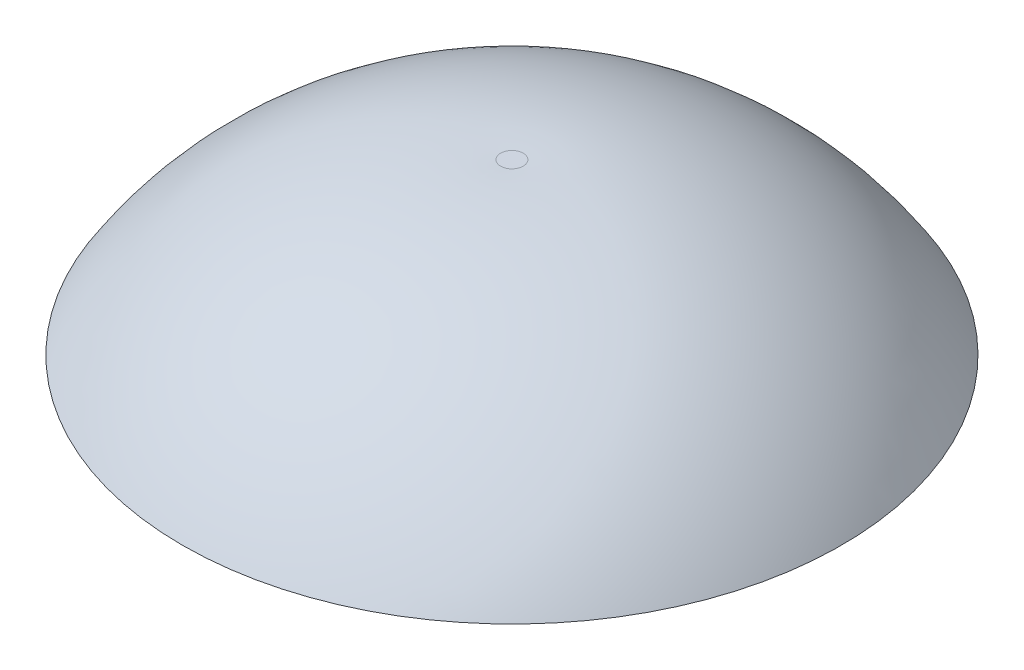
ISO-10303-21;
HEADER;
FILE_DESCRIPTION(('STEP AP214'),'2;1');
FILE_NAME('part.step','',(''),(''),'','','');
FILE_SCHEMA(('AUTOMOTIVE_DESIGN { 1 0 10303 214 1 1 1 1 }'));
ENDSEC;
DATA;
#1=APPLICATION_CONTEXT('core data for automotive mechanical design processes');
#2=APPLICATION_PROTOCOL_DEFINITION('international standard','automotive_design',2000,#1);
#3=PRODUCT_CONTEXT('',#1,'mechanical');
#4=PRODUCT('Part','Part','',(#3));
#5=PRODUCT_RELATED_PRODUCT_CATEGORY('part','',(#4));
#6=PRODUCT_DEFINITION_FORMATION('','',#4);
#7=PRODUCT_DEFINITION_CONTEXT('part definition',#1,'design');
#8=PRODUCT_DEFINITION('design','',#6,#7);
#9=PRODUCT_DEFINITION_SHAPE('','',#8);
#10=(LENGTH_UNIT() NAMED_UNIT(*) SI_UNIT(.MILLI.,.METRE.));
#11=(NAMED_UNIT(*) PLANE_ANGLE_UNIT() SI_UNIT($,.RADIAN.));
#12=(NAMED_UNIT(*) SI_UNIT($,.STERADIAN.) SOLID_ANGLE_UNIT());
#13=UNCERTAINTY_MEASURE_WITH_UNIT(LENGTH_MEASURE(1.E-05),#10,'distance_accuracy_value','');
#14=(GEOMETRIC_REPRESENTATION_CONTEXT(3) GLOBAL_UNCERTAINTY_ASSIGNED_CONTEXT((#13)) GLOBAL_UNIT_ASSIGNED_CONTEXT((#10,
#11,#12)) REPRESENTATION_CONTEXT('',''));
#15=CARTESIAN_POINT('',(0.,0.,0.));
#16=DIRECTION('',(0.,0.,1.));
#17=DIRECTION('',(1.,0.,0.));
#18=AXIS2_PLACEMENT_3D('',#15,#16,#17);
#19=CARTESIAN_POINT('',(0.,101.6,0.));
#20=DIRECTION('',(0.,1.,0.));
#21=DIRECTION('',(0.,0.,1.));
#22=AXIS2_PLACEMENT_3D('',#19,#20,#21);
#23=PLANE('',#22);
#24=DIRECTION('',(-0.707106781186546,0.,-0.707106781186549));
#25=VECTOR('',#24,1.);
#26=CARTESIAN_POINT('',(0.,101.6,0.));
#27=LINE('',#26,#25);
#28=CARTESIAN_POINT('',(-4.49012806053457,101.6,-4.49012806053458));
#29=VERTEX_POINT('',#28);
#30=CARTESIAN_POINT('',(-6.73519209080185,101.6,-6.73519209080188));
#31=VERTEX_POINT('',#30);
#32=EDGE_CURVE('E166',#29,#31,#27,.T.);
#33=ORIENTED_EDGE('',*,*,#32,.T.);
#34=CARTESIAN_POINT('',(0.,101.6,0.));
#35=DIRECTION('',(0.,1.,0.));
#36=DIRECTION('',(0.,0.,1.));
#37=AXIS2_PLACEMENT_3D('',#34,#35,#36);
#38=CIRCLE('',#37,9.525);
#39=CARTESIAN_POINT('',(6.73519209080185,101.6,-6.73519209080188));
#40=VERTEX_POINT('',#39);
#41=EDGE_CURVE('E228',#40,#31,#38,.T.);
#42=ORIENTED_EDGE('',*,*,#41,.F.);
#43=DIRECTION('',(0.707106781186546,0.,-0.707106781186549));
#44=VECTOR('',#43,1.);
#45=CARTESIAN_POINT('',(0.,101.6,0.));
#46=LINE('',#45,#44);
#47=CARTESIAN_POINT('',(4.49012806053457,101.6,-4.49012806053458));
#48=VERTEX_POINT('',#47);
#49=EDGE_CURVE('E193',#48,#40,#46,.T.);
#50=ORIENTED_EDGE('',*,*,#49,.F.);
#51=CARTESIAN_POINT('',(0.,101.6,0.));
#52=DIRECTION('',(0.,1.,0.));
#53=DIRECTION('',(0.,0.,1.));
#54=AXIS2_PLACEMENT_3D('',#51,#52,#53);
#55=CIRCLE('',#54,6.35);
#56=CARTESIAN_POINT('',(4.49012806053457,101.6,4.49012806053458));
#57=VERTEX_POINT('',#56);
#58=EDGE_CURVE('E60',#57,#48,#55,.T.);
#59=ORIENTED_EDGE('',*,*,#58,.F.);
#60=DIRECTION('',(0.707106781186546,0.,0.707106781186549));
#61=VECTOR('',#60,1.);
#62=CARTESIAN_POINT('',(0.,101.6,0.));
#63=LINE('',#62,#61);
#64=CARTESIAN_POINT('',(6.73519209080185,101.6,6.73519209080188));
#65=VERTEX_POINT('',#64);
#66=EDGE_CURVE('E211',#57,#65,#63,.T.);
#67=ORIENTED_EDGE('',*,*,#66,.T.);
#68=CARTESIAN_POINT('',(-6.73519209080185,101.6,6.73519209080188));
#69=VERTEX_POINT('',#68);
#70=EDGE_CURVE('E227',#69,#65,#38,.T.);
#71=ORIENTED_EDGE('',*,*,#70,.F.);
#72=DIRECTION('',(-0.707106781186546,0.,0.707106781186549));
#73=VECTOR('',#72,1.);
#74=CARTESIAN_POINT('',(0.,101.6,0.));
#75=LINE('',#74,#73);
#76=CARTESIAN_POINT('',(-4.49012806053457,101.6,4.49012806053458));
#77=VERTEX_POINT('',#76);
#78=EDGE_CURVE('E154',#77,#69,#75,.T.);
#79=ORIENTED_EDGE('',*,*,#78,.F.);
#80=CARTESIAN_POINT('',(0.,101.6,0.));
#81=DIRECTION('',(0.,1.,0.));
#82=DIRECTION('',(0.,0.,1.));
#83=AXIS2_PLACEMENT_3D('',#80,#81,#82);
#84=CIRCLE('',#83,6.35);
#85=EDGE_CURVE('E179',#29,#77,#84,.T.);
#86=ORIENTED_EDGE('',*,*,#85,.F.);
#87=EDGE_LOOP('',(#33,#42,#50,#59,#67,#71,#79,#86));
#88=FACE_BOUND('',#87,.T.);
#89=ADVANCED_FACE('F38',(#88),#23,.F.);
#90=CARTESIAN_POINT('',(0.,133.35,0.));
#91=DIRECTION('',(0.,1.,0.));
#92=DIRECTION('',(0.,0.,1.));
#93=AXIS2_PLACEMENT_3D('',#90,#91,#92);
#94=CYLINDRICAL_SURFACE('',#93,9.525);
#95=ORIENTED_EDGE('',*,*,#41,.T.);
#96=DIRECTION('',(0.,-1.,0.));
#97=VECTOR('',#96,1.);
#98=CARTESIAN_POINT('',(-6.73519209080185,0.,-6.73519209080188));
#99=LINE('',#98,#97);
#100=CARTESIAN_POINT('',(-6.73519209080185,95.25,-6.73519209080188));
#101=VERTEX_POINT('',#100);
#102=EDGE_CURVE('E169',#31,#101,#99,.T.);
#103=ORIENTED_EDGE('',*,*,#102,.T.);
#104=CARTESIAN_POINT('',(0.,95.25,0.));
#105=DIRECTION('',(0.,1.,0.));
#106=DIRECTION('',(0.,0.,1.));
#107=AXIS2_PLACEMENT_3D('',#104,#105,#106);
#108=CIRCLE('',#107,9.525);
#109=CARTESIAN_POINT('',(-6.73519209080185,95.25,6.73519209080188));
#110=VERTEX_POINT('',#109);
#111=EDGE_CURVE('E177',#101,#110,#108,.T.);
#112=ORIENTED_EDGE('',*,*,#111,.T.);
#113=DIRECTION('',(0.,-1.,0.));
#114=VECTOR('',#113,1.);
#115=CARTESIAN_POINT('',(-6.73519209080185,0.,6.73519209080188));
#116=LINE('',#115,#114);
#117=EDGE_CURVE('E52',#69,#110,#116,.T.);
#118=ORIENTED_EDGE('',*,*,#117,.F.);
#119=ORIENTED_EDGE('',*,*,#70,.T.);
#120=DIRECTION('',(0.,-1.,0.));
#121=VECTOR('',#120,1.);
#122=CARTESIAN_POINT('',(6.73519209080185,0.,6.73519209080188));
#123=LINE('',#122,#121);
#124=CARTESIAN_POINT('',(6.73519209080185,95.25,6.73519209080188));
#125=VERTEX_POINT('',#124);
#126=EDGE_CURVE('E208',#65,#125,#123,.T.);
#127=ORIENTED_EDGE('',*,*,#126,.T.);
#128=CARTESIAN_POINT('',(0.,95.25,0.));
#129=DIRECTION('',(0.,1.,0.));
#130=DIRECTION('',(0.,0.,1.));
#131=AXIS2_PLACEMENT_3D('',#128,#129,#130);
#132=CIRCLE('',#131,9.525);
#133=CARTESIAN_POINT('',(6.73519209080185,95.25,-6.73519209080188));
#134=VERTEX_POINT('',#133);
#135=EDGE_CURVE('E219',#125,#134,#132,.T.);
#136=ORIENTED_EDGE('',*,*,#135,.T.);
#137=DIRECTION('',(0.,-1.,0.));
#138=VECTOR('',#137,1.);
#139=CARTESIAN_POINT('',(6.73519209080185,0.,-6.73519209080188));
#140=LINE('',#139,#138);
#141=EDGE_CURVE('E190',#40,#134,#140,.T.);
#142=ORIENTED_EDGE('',*,*,#141,.F.);
#143=EDGE_LOOP('',(#95,#103,#112,#118,#119,#127,#136,#142));
#144=FACE_BOUND('',#143,.T.);
#145=CARTESIAN_POINT('',(0.,104.902,0.));
#146=DIRECTION('',(0.,1.,0.));
#147=DIRECTION('',(0.,0.,1.));
#148=AXIS2_PLACEMENT_3D('',#145,#146,#147);
#149=CIRCLE('',#148,9.525);
#150=CARTESIAN_POINT('',(0.,104.902,9.525));
#151=VERTEX_POINT('',#150);
#152=EDGE_CURVE('E225',#151,#151,#149,.T.);
#153=ORIENTED_EDGE('',*,*,#152,.F.);
#154=EDGE_LOOP('',(#153));
#155=FACE_BOUND('',#154,.T.);
#156=ADVANCED_FACE('F233',(#144,#155),#94,.T.);
#157=CARTESIAN_POINT('',(0.,104.902,0.));
#158=DIRECTION('',(0.,1.,0.));
#159=DIRECTION('',(0.,0.,1.));
#160=AXIS2_PLACEMENT_3D('',#157,#158,#159);
#161=PLANE('',#160);
#162=CARTESIAN_POINT('',(0.,104.902,0.));
#163=DIRECTION('',(0.,1.,0.));
#164=DIRECTION('',(0.,0.,1.));
#165=AXIS2_PLACEMENT_3D('',#162,#163,#164);
#166=CIRCLE('',#165,2.54);
#167=CARTESIAN_POINT('',(0.,104.902,2.54));
#168=VERTEX_POINT('',#167);
#169=EDGE_CURVE('E45',#168,#168,#166,.T.);
#170=ORIENTED_EDGE('',*,*,#169,.F.);
#171=EDGE_LOOP('',(#170));
#172=FACE_BOUND('',#171,.T.);
#173=ORIENTED_EDGE('',*,*,#152,.T.);
#174=EDGE_LOOP('',(#173));
#175=FACE_BOUND('',#174,.T.);
#176=ADVANCED_FACE('F258',(#172,#175),#161,.T.);
#177=CARTESIAN_POINT('',(0.,97.79,0.));
#178=DIRECTION('',(0.,1.,0.));
#179=DIRECTION('',(0.,0.,1.));
#180=AXIS2_PLACEMENT_3D('',#177,#178,#179);
#181=PLANE('',#180);
#182=CARTESIAN_POINT('',(0.,97.79,0.));
#183=DIRECTION('',(0.,1.,0.));
#184=DIRECTION('',(0.,0.,1.));
#185=AXIS2_PLACEMENT_3D('',#182,#183,#184);
#186=CIRCLE('',#185,3.93700000000001);
#187=CARTESIAN_POINT('',(2.78387939753144,97.79,2.78387939753145));
#188=VERTEX_POINT('',#187);
#189=CARTESIAN_POINT('',(2.78387939753144,97.79,-2.78387939753145));
#190=VERTEX_POINT('',#189);
#191=EDGE_CURVE('E223',#188,#190,#186,.T.);
#192=ORIENTED_EDGE('',*,*,#191,.F.);
#193=DIRECTION('',(0.707106781186546,0.,0.707106781186549));
#194=VECTOR('',#193,1.);
#195=CARTESIAN_POINT('',(0.,97.79,0.));
#196=LINE('',#195,#194);
#197=CARTESIAN_POINT('',(4.49012806053457,97.79,4.49012806053458));
#198=VERTEX_POINT('',#197);
#199=EDGE_CURVE('E199',#188,#198,#196,.T.);
#200=ORIENTED_EDGE('',*,*,#199,.T.);
#201=CARTESIAN_POINT('',(0.,97.79,0.));
#202=DIRECTION('',(0.,1.,0.));
#203=DIRECTION('',(0.,0.,1.));
#204=AXIS2_PLACEMENT_3D('',#201,#202,#203);
#205=CIRCLE('',#204,6.35);
#206=CARTESIAN_POINT('',(4.49012806053457,97.79,-4.49012806053458));
#207=VERTEX_POINT('',#206);
#208=EDGE_CURVE('E216',#198,#207,#205,.T.);
#209=ORIENTED_EDGE('',*,*,#208,.T.);
#210=DIRECTION('',(0.707106781186546,0.,-0.707106781186549));
#211=VECTOR('',#210,1.);
#212=CARTESIAN_POINT('',(0.,97.79,0.));
#213=LINE('',#212,#211);
#214=EDGE_CURVE('E138',#190,#207,#213,.T.);
#215=ORIENTED_EDGE('',*,*,#214,.F.);
#216=EDGE_LOOP('',(#192,#200,#209,#215));
#217=FACE_BOUND('',#216,.T.);
#218=ADVANCED_FACE('F256',(#217),#181,.T.);
#219=CARTESIAN_POINT('',(0.,133.35,0.));
#220=DIRECTION('',(0.,1.,0.));
#221=DIRECTION('',(0.,0.,1.));
#222=AXIS2_PLACEMENT_3D('',#219,#220,#221);
#223=CYLINDRICAL_SURFACE('',#222,3.93700000000001);
#224=CARTESIAN_POINT('',(0.,95.25,0.));
#225=DIRECTION('',(0.,1.,0.));
#226=DIRECTION('',(0.,0.,1.));
#227=AXIS2_PLACEMENT_3D('',#224,#225,#226);
#228=CIRCLE('',#227,3.93700000000001);
#229=CARTESIAN_POINT('',(2.78387939753144,95.25,2.78387939753145));
#230=VERTEX_POINT('',#229);
#231=CARTESIAN_POINT('',(2.78387939753144,95.25,-2.78387939753145));
#232=VERTEX_POINT('',#231);
#233=EDGE_CURVE('E221',#230,#232,#228,.T.);
#234=ORIENTED_EDGE('',*,*,#233,.F.);
#235=DIRECTION('',(0.,-1.,0.));
#236=VECTOR('',#235,1.);
#237=CARTESIAN_POINT('',(2.78387939753144,0.,2.78387939753145));
#238=LINE('',#237,#236);
#239=EDGE_CURVE('E202',#188,#230,#238,.T.);
#240=ORIENTED_EDGE('',*,*,#239,.F.);
#241=ORIENTED_EDGE('',*,*,#191,.T.);
#242=DIRECTION('',(0.,-1.,0.));
#243=VECTOR('',#242,1.);
#244=CARTESIAN_POINT('',(2.78387939753144,0.,-2.78387939753145));
#245=LINE('',#244,#243);
#246=EDGE_CURVE('E184',#190,#232,#245,.T.);
#247=ORIENTED_EDGE('',*,*,#246,.T.);
#248=EDGE_LOOP('',(#234,#240,#241,#247));
#249=FACE_BOUND('',#248,.T.);
#250=ADVANCED_FACE('F253',(#249),#223,.F.);
#251=CARTESIAN_POINT('',(0.,95.25,0.));
#252=DIRECTION('',(0.,1.,0.));
#253=DIRECTION('',(0.,0.,1.));
#254=AXIS2_PLACEMENT_3D('',#251,#252,#253);
#255=PLANE('',#254);
#256=ORIENTED_EDGE('',*,*,#135,.F.);
#257=DIRECTION('',(0.707106781186546,0.,0.707106781186549));
#258=VECTOR('',#257,1.);
#259=CARTESIAN_POINT('',(0.,95.25,0.));
#260=LINE('',#259,#258);
#261=EDGE_CURVE('E205',#230,#125,#260,.T.);
#262=ORIENTED_EDGE('',*,*,#261,.F.);
#263=ORIENTED_EDGE('',*,*,#233,.T.);
#264=DIRECTION('',(0.707106781186546,0.,-0.707106781186549));
#265=VECTOR('',#264,1.);
#266=CARTESIAN_POINT('',(0.,95.25,0.));
#267=LINE('',#266,#265);
#268=EDGE_CURVE('E187',#232,#134,#267,.T.);
#269=ORIENTED_EDGE('',*,*,#268,.T.);
#270=EDGE_LOOP('',(#256,#262,#263,#269));
#271=FACE_BOUND('',#270,.T.);
#272=ADVANCED_FACE('F244',(#271),#255,.F.);
#273=CARTESIAN_POINT('',(0.,133.35,0.));
#274=DIRECTION('',(0.,1.,0.));
#275=DIRECTION('',(0.,0.,1.));
#276=AXIS2_PLACEMENT_3D('',#273,#274,#275);
#277=CYLINDRICAL_SURFACE('',#276,6.35);
#278=DIRECTION('',(0.,-1.,0.));
#279=VECTOR('',#278,1.);
#280=CARTESIAN_POINT('',(4.49012806053457,0.,4.49012806053458));
#281=LINE('',#280,#279);
#282=EDGE_CURVE('E213',#57,#198,#281,.T.);
#283=ORIENTED_EDGE('',*,*,#282,.F.);
#284=ORIENTED_EDGE('',*,*,#58,.T.);
#285=DIRECTION('',(0.,-1.,0.));
#286=VECTOR('',#285,1.);
#287=CARTESIAN_POINT('',(4.49012806053457,0.,-4.49012806053458));
#288=LINE('',#287,#286);
#289=EDGE_CURVE('E196',#48,#207,#288,.T.);
#290=ORIENTED_EDGE('',*,*,#289,.T.);
#291=ORIENTED_EDGE('',*,*,#208,.F.);
#292=EDGE_LOOP('',(#283,#284,#290,#291));
#293=FACE_BOUND('',#292,.T.);
#294=ADVANCED_FACE('F250',(#293),#277,.F.);
#295=CARTESIAN_POINT('',(0.,0.,0.));
#296=DIRECTION('',(-0.707106781186549,0.,0.707106781186546));
#297=DIRECTION('',(0.707106781186546,0.,0.707106781186549));
#298=AXIS2_PLACEMENT_3D('',#295,#296,#297);
#299=PLANE('',#298);
#300=ORIENTED_EDGE('',*,*,#199,.F.);
#301=ORIENTED_EDGE('',*,*,#239,.T.);
#302=ORIENTED_EDGE('',*,*,#261,.T.);
#303=ORIENTED_EDGE('',*,*,#126,.F.);
#304=ORIENTED_EDGE('',*,*,#66,.F.);
#305=ORIENTED_EDGE('',*,*,#282,.T.);
#306=EDGE_LOOP('',(#300,#301,#302,#303,#304,#305));
#307=FACE_BOUND('',#306,.T.);
#308=ADVANCED_FACE('F240',(#307),#299,.T.);
#309=CARTESIAN_POINT('',(0.,0.,0.));
#310=DIRECTION('',(0.707106781186549,0.,0.707106781186546));
#311=DIRECTION('',(0.707106781186546,0.,-0.707106781186549));
#312=AXIS2_PLACEMENT_3D('',#309,#310,#311);
#313=PLANE('',#312);
#314=ORIENTED_EDGE('',*,*,#214,.T.);
#315=ORIENTED_EDGE('',*,*,#289,.F.);
#316=ORIENTED_EDGE('',*,*,#49,.T.);
#317=ORIENTED_EDGE('',*,*,#141,.T.);
#318=ORIENTED_EDGE('',*,*,#268,.F.);
#319=ORIENTED_EDGE('',*,*,#246,.F.);
#320=EDGE_LOOP('',(#314,#315,#316,#317,#318,#319));
#321=FACE_BOUND('',#320,.T.);
#322=ADVANCED_FACE('F248',(#321),#313,.F.);
#323=CARTESIAN_POINT('',(0.,133.35,0.));
#324=DIRECTION('',(0.,1.,0.));
#325=DIRECTION('',(0.,0.,1.));
#326=AXIS2_PLACEMENT_3D('',#323,#324,#325);
#327=CYLINDRICAL_SURFACE('',#326,3.93700000000001);
#328=CARTESIAN_POINT('',(0.,97.79,0.));
#329=DIRECTION('',(0.,1.,0.));
#330=DIRECTION('',(0.,0.,1.));
#331=AXIS2_PLACEMENT_3D('',#328,#329,#330);
#332=CIRCLE('',#331,3.93700000000001);
#333=CARTESIAN_POINT('',(-2.78387939753144,97.79,-2.78387939753145));
#334=VERTEX_POINT('',#333);
#335=CARTESIAN_POINT('',(-2.78387939753144,97.79,2.78387939753145));
#336=VERTEX_POINT('',#335);
#337=EDGE_CURVE('E127',#334,#336,#332,.T.);
#338=ORIENTED_EDGE('',*,*,#337,.T.);
#339=DIRECTION('',(0.,-1.,0.));
#340=VECTOR('',#339,1.);
#341=CARTESIAN_POINT('',(-2.78387939753144,0.,2.78387939753145));
#342=LINE('',#341,#340);
#343=CARTESIAN_POINT('',(-2.78387939753144,95.25,2.78387939753145));
#344=VERTEX_POINT('',#343);
#345=EDGE_CURVE('E130',#336,#344,#342,.T.);
#346=ORIENTED_EDGE('',*,*,#345,.T.);
#347=CARTESIAN_POINT('',(0.,95.25,0.));
#348=DIRECTION('',(0.,1.,0.));
#349=DIRECTION('',(0.,0.,1.));
#350=AXIS2_PLACEMENT_3D('',#347,#348,#349);
#351=CIRCLE('',#350,3.93700000000001);
#352=CARTESIAN_POINT('',(-2.78387939753144,95.25,-2.78387939753145));
#353=VERTEX_POINT('',#352);
#354=EDGE_CURVE('E175',#353,#344,#351,.T.);
#355=ORIENTED_EDGE('',*,*,#354,.F.);
#356=DIRECTION('',(0.,-1.,0.));
#357=VECTOR('',#356,1.);
#358=CARTESIAN_POINT('',(-2.78387939753144,0.,-2.78387939753145));
#359=LINE('',#358,#357);
#360=EDGE_CURVE('E133',#334,#353,#359,.T.);
#361=ORIENTED_EDGE('',*,*,#360,.F.);
#362=EDGE_LOOP('',(#338,#346,#355,#361));
#363=FACE_BOUND('',#362,.T.);
#364=ADVANCED_FACE('F129',(#363),#327,.F.);
#365=CARTESIAN_POINT('',(0.,97.79,0.));
#366=DIRECTION('',(0.,1.,0.));
#367=DIRECTION('',(0.,0.,1.));
#368=AXIS2_PLACEMENT_3D('',#365,#366,#367);
#369=PLANE('',#368);
#370=CARTESIAN_POINT('',(0.,97.79,0.));
#371=DIRECTION('',(0.,1.,0.));
#372=DIRECTION('',(0.,0.,1.));
#373=AXIS2_PLACEMENT_3D('',#370,#371,#372);
#374=CIRCLE('',#373,6.35);
#375=CARTESIAN_POINT('',(-4.49012806053457,97.79,-4.49012806053458));
#376=VERTEX_POINT('',#375);
#377=CARTESIAN_POINT('',(-4.49012806053457,97.79,4.49012806053458));
#378=VERTEX_POINT('',#377);
#379=EDGE_CURVE('E139',#376,#378,#374,.T.);
#380=ORIENTED_EDGE('',*,*,#379,.T.);
#381=DIRECTION('',(-0.707106781186546,0.,0.707106781186549));
#382=VECTOR('',#381,1.);
#383=CARTESIAN_POINT('',(0.,97.79,0.));
#384=LINE('',#383,#382);
#385=EDGE_CURVE('E145',#336,#378,#384,.T.);
#386=ORIENTED_EDGE('',*,*,#385,.F.);
#387=ORIENTED_EDGE('',*,*,#337,.F.);
#388=DIRECTION('',(-0.707106781186546,0.,-0.707106781186549));
#389=VECTOR('',#388,1.);
#390=CARTESIAN_POINT('',(0.,97.79,0.));
#391=LINE('',#390,#389);
#392=EDGE_CURVE('E162',#334,#376,#391,.T.);
#393=ORIENTED_EDGE('',*,*,#392,.T.);
#394=EDGE_LOOP('',(#380,#386,#387,#393));
#395=FACE_BOUND('',#394,.T.);
#396=ADVANCED_FACE('F151',(#395),#369,.T.);
#397=CARTESIAN_POINT('',(0.,133.35,0.));
#398=DIRECTION('',(0.,1.,0.));
#399=DIRECTION('',(0.,0.,1.));
#400=AXIS2_PLACEMENT_3D('',#397,#398,#399);
#401=CYLINDRICAL_SURFACE('',#400,6.35);
#402=ORIENTED_EDGE('',*,*,#85,.T.);
#403=DIRECTION('',(0.,1.,0.));
#404=VECTOR('',#403,1.);
#405=CARTESIAN_POINT('',(-4.49012806053457,0.,4.49012806053458));
#406=LINE('',#405,#404);
#407=EDGE_CURVE('E152',#378,#77,#406,.T.);
#408=ORIENTED_EDGE('',*,*,#407,.F.);
#409=ORIENTED_EDGE('',*,*,#379,.F.);
#410=DIRECTION('',(0.,1.,0.));
#411=VECTOR('',#410,1.);
#412=CARTESIAN_POINT('',(-4.49012806053457,0.,-4.49012806053458));
#413=LINE('',#412,#411);
#414=EDGE_CURVE('E164',#376,#29,#413,.T.);
#415=ORIENTED_EDGE('',*,*,#414,.T.);
#416=EDGE_LOOP('',(#402,#408,#409,#415));
#417=FACE_BOUND('',#416,.T.);
#418=ADVANCED_FACE('F288',(#417),#401,.F.);
#419=CARTESIAN_POINT('',(0.,95.25,0.));
#420=DIRECTION('',(0.,1.,0.));
#421=DIRECTION('',(0.,0.,1.));
#422=AXIS2_PLACEMENT_3D('',#419,#420,#421);
#423=PLANE('',#422);
#424=DIRECTION('',(-0.707106781186546,0.,-0.707106781186549));
#425=VECTOR('',#424,1.);
#426=CARTESIAN_POINT('',(0.,95.25,0.));
#427=LINE('',#426,#425);
#428=EDGE_CURVE('E172',#353,#101,#427,.T.);
#429=ORIENTED_EDGE('',*,*,#428,.F.);
#430=ORIENTED_EDGE('',*,*,#354,.T.);
#431=DIRECTION('',(-0.707106781186546,0.,0.707106781186549));
#432=VECTOR('',#431,1.);
#433=CARTESIAN_POINT('',(0.,95.25,0.));
#434=LINE('',#433,#432);
#435=EDGE_CURVE('E148',#344,#110,#434,.T.);
#436=ORIENTED_EDGE('',*,*,#435,.T.);
#437=ORIENTED_EDGE('',*,*,#111,.F.);
#438=EDGE_LOOP('',(#429,#430,#436,#437));
#439=FACE_BOUND('',#438,.T.);
#440=ADVANCED_FACE('F291',(#439),#423,.F.);
#441=CARTESIAN_POINT('',(0.,0.,0.));
#442=DIRECTION('',(-0.707106781186549,0.,0.707106781186546));
#443=DIRECTION('',(0.707106781186546,0.,0.707106781186549));
#444=AXIS2_PLACEMENT_3D('',#441,#442,#443);
#445=PLANE('',#444);
#446=ORIENTED_EDGE('',*,*,#360,.T.);
#447=ORIENTED_EDGE('',*,*,#428,.T.);
#448=ORIENTED_EDGE('',*,*,#102,.F.);
#449=ORIENTED_EDGE('',*,*,#32,.F.);
#450=ORIENTED_EDGE('',*,*,#414,.F.);
#451=ORIENTED_EDGE('',*,*,#392,.F.);
#452=EDGE_LOOP('',(#446,#447,#448,#449,#450,#451));
#453=FACE_BOUND('',#452,.T.);
#454=ADVANCED_FACE('F295',(#453),#445,.F.);
#455=CARTESIAN_POINT('',(0.,0.,0.));
#456=DIRECTION('',(0.707106781186549,0.,0.707106781186546));
#457=DIRECTION('',(0.707106781186546,0.,-0.707106781186549));
#458=AXIS2_PLACEMENT_3D('',#455,#456,#457);
#459=PLANE('',#458);
#460=ORIENTED_EDGE('',*,*,#345,.F.);
#461=ORIENTED_EDGE('',*,*,#385,.T.);
#462=ORIENTED_EDGE('',*,*,#407,.T.);
#463=ORIENTED_EDGE('',*,*,#78,.T.);
#464=ORIENTED_EDGE('',*,*,#117,.T.);
#465=ORIENTED_EDGE('',*,*,#435,.F.);
#466=EDGE_LOOP('',(#460,#461,#462,#463,#464,#465));
#467=FACE_BOUND('',#466,.T.);
#468=ADVANCED_FACE('F143',(#467),#459,.T.);
#469=CARTESIAN_POINT('',(0.,133.35,0.));
#470=DIRECTION('',(0.,1.,0.));
#471=DIRECTION('',(0.,0.,1.));
#472=AXIS2_PLACEMENT_3D('',#469,#470,#471);
#473=CYLINDRICAL_SURFACE('',#472,2.54);
#474=CARTESIAN_POINT('',(0.,130.866278234987,0.));
#475=DIRECTION('',(0.,-1.,0.));
#476=DIRECTION('',(0.,0.,-1.));
#477=AXIS2_PLACEMENT_3D('',#474,#475,#476);
#478=CIRCLE('',#477,2.54);
#479=CARTESIAN_POINT('',(0.,130.866278234987,-2.54));
#480=VERTEX_POINT('',#479);
#481=EDGE_CURVE('E11',#480,#480,#478,.F.);
#482=ORIENTED_EDGE('',*,*,#481,.F.);
#483=EDGE_LOOP('',(#482));
#484=FACE_BOUND('',#483,.T.);
#485=ORIENTED_EDGE('',*,*,#169,.T.);
#486=EDGE_LOOP('',(#485));
#487=FACE_BOUND('',#486,.T.);
#488=ADVANCED_FACE('F304',(#484,#487),#473,.T.);
#489=CARTESIAN_POINT('',(0.,130.866278234987,0.));
#490=DIRECTION('',(0.,-1.,0.));
#491=DIRECTION('',(0.,0.,-1.));
#492=AXIS2_PLACEMENT_3D('',#489,#490,#491);
#493=PLANE('',#492);
#494=ORIENTED_EDGE('',*,*,#481,.T.);
#495=EDGE_LOOP('',(#494));
#496=FACE_BOUND('',#495,.T.);
#497=CARTESIAN_POINT('',(0.,130.866278234987,0.));
#498=DIRECTION('',(0.,1.,0.));
#499=DIRECTION('',(0.,0.,1.));
#500=AXIS2_PLACEMENT_3D('',#497,#498,#499);
#501=CIRCLE('',#500,5.08);
#502=CARTESIAN_POINT('',(0.,130.866278234987,5.08));
#503=VERTEX_POINT('',#502);
#504=EDGE_CURVE('E149',#503,#503,#501,.T.);
#505=ORIENTED_EDGE('',*,*,#504,.F.);
#506=EDGE_LOOP('',(#505));
#507=FACE_BOUND('',#506,.T.);
#508=ADVANCED_FACE('F307',(#496,#507),#493,.T.);
#509=CARTESIAN_POINT('',(0.,52.5882609623906,0.));
#510=DIRECTION('',(0.,1.,0.));
#511=DIRECTION('',(0.,0.,1.));
#512=AXIS2_PLACEMENT_3D('',#509,#510,#511);
#513=DEGENERATE_TOROIDAL_SURFACE('',#512,5.60178301771871,78.279756295268,.T.);
#514=ORIENTED_EDGE('',*,*,#504,.T.);
#515=EDGE_LOOP('',(#514));
#516=FACE_BOUND('',#515,.T.);
#517=CARTESIAN_POINT('',(0.,93.9092286079206,0.));
#518=DIRECTION('',(0.,1.,0.));
#519=DIRECTION('',(0.,0.,1.));
#520=AXIS2_PLACEMENT_3D('',#517,#518,#519);
#521=CIRCLE('',#520,72.0871037921845);
#522=CARTESIAN_POINT('',(0.,93.9092286079206,72.0871037921845));
#523=VERTEX_POINT('',#522);
#524=EDGE_CURVE('E332',#523,#523,#521,.T.);
#525=ORIENTED_EDGE('',*,*,#524,.F.);
#526=EDGE_LOOP('',(#525));
#527=FACE_BOUND('',#526,.T.);
#528=ADVANCED_FACE('F317',(#516,#527),#513,.F.);
#529=CARTESIAN_POINT('',(0.,95.25,0.));
#530=DIRECTION('',(0.,1.,0.));
#531=DIRECTION('',(0.,0.,1.));
#532=AXIS2_PLACEMENT_3D('',#529,#530,#531);
#533=CONICAL_SURFACE('',#532,74.2444011926793,1.0147141278857);
#534=ORIENTED_EDGE('',*,*,#524,.T.);
#535=EDGE_LOOP('',(#534));
#536=FACE_BOUND('',#535,.T.);
#537=CARTESIAN_POINT('',(0.,95.25,0.));
#538=DIRECTION('',(0.,1.,0.));
#539=DIRECTION('',(0.,0.,1.));
#540=AXIS2_PLACEMENT_3D('',#537,#538,#539);
#541=CIRCLE('',#540,74.2444011926793);
#542=CARTESIAN_POINT('',(0.,95.25,74.2444011926793));
#543=VERTEX_POINT('',#542);
#544=EDGE_CURVE('E335',#543,#543,#541,.T.);
#545=ORIENTED_EDGE('',*,*,#544,.F.);
#546=EDGE_LOOP('',(#545));
#547=FACE_BOUND('',#546,.T.);
#548=ADVANCED_FACE('F313',(#536,#547),#533,.T.);
#549=CARTESIAN_POINT('',(0.,133.35,0.));
#550=DIRECTION('',(0.,1.,0.));
#551=DIRECTION('',(0.,0.,1.));
#552=AXIS2_PLACEMENT_3D('',#549,#550,#551);
#553=PLANE('',#552);
#554=CARTESIAN_POINT('',(0.,133.35,0.));
#555=DIRECTION('',(0.,1.,0.));
#556=DIRECTION('',(0.,0.,1.));
#557=AXIS2_PLACEMENT_3D('',#554,#555,#556);
#558=CIRCLE('',#557,2.54);
#559=CARTESIAN_POINT('',(0.,133.35,2.54));
#560=VERTEX_POINT('',#559);
#561=EDGE_CURVE('E338',#560,#560,#558,.T.);
#562=ORIENTED_EDGE('',*,*,#561,.T.);
#563=EDGE_LOOP('',(#562));
#564=FACE_BOUND('',#563,.T.);
#565=ADVANCED_FACE('F309',(#564),#553,.T.);
#566=CARTESIAN_POINT('',(0.,52.5882609623906,0.));
#567=DIRECTION('',(0.,1.,0.));
#568=DIRECTION('',(0.,0.,1.));
#569=AXIS2_PLACEMENT_3D('',#566,#567,#568);
#570=DEGENERATE_TOROIDAL_SURFACE('',#569,5.60178301771871,80.819756295268,.T.);
#571=ORIENTED_EDGE('',*,*,#561,.F.);
#572=EDGE_LOOP('',(#571));
#573=FACE_BOUND('',#572,.T.);
#574=ORIENTED_EDGE('',*,*,#544,.T.);
#575=EDGE_LOOP('',(#574));
#576=FACE_BOUND('',#575,.T.);
#577=ADVANCED_FACE('F312',(#573,#576),#570,.T.);
#578=CLOSED_SHELL('',(#89,#156,#176,#218,#250,#272,#294,#308,#322,#364,#396,#418,#440,#454,#468,
#488,#508,#528,#548,#565,#577));
#579=MANIFOLD_SOLID_BREP('B2',#578);
#580=ADVANCED_BREP_SHAPE_REPRESENTATION('',(#18,#579),#14);
#581=SHAPE_DEFINITION_REPRESENTATION(#9,#580);
ENDSEC;
END-ISO-10303-21;
